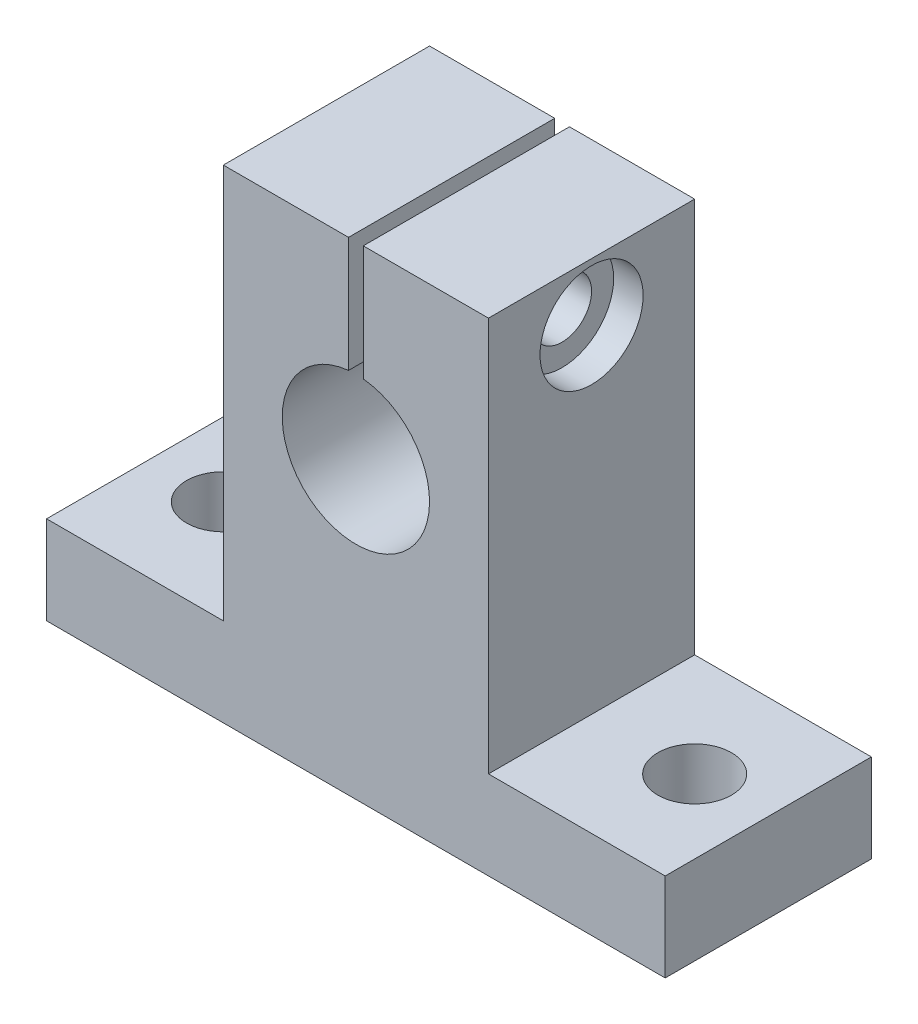
ISO-10303-21;
HEADER;
FILE_DESCRIPTION(('STEP AP214'),'2;1');
FILE_NAME('part.step','',(''),(''),'','','');
FILE_SCHEMA(('AUTOMOTIVE_DESIGN { 1 0 10303 214 1 1 1 1 }'));
ENDSEC;
DATA;
#1=APPLICATION_CONTEXT('core data for automotive mechanical design processes');
#2=APPLICATION_PROTOCOL_DEFINITION('international standard','automotive_design',2000,#1);
#3=PRODUCT_CONTEXT('',#1,'mechanical');
#4=PRODUCT('Part','Part','',(#3));
#5=PRODUCT_RELATED_PRODUCT_CATEGORY('part','',(#4));
#6=PRODUCT_DEFINITION_FORMATION('','',#4);
#7=PRODUCT_DEFINITION_CONTEXT('part definition',#1,'design');
#8=PRODUCT_DEFINITION('design','',#6,#7);
#9=PRODUCT_DEFINITION_SHAPE('','',#8);
#10=(LENGTH_UNIT() NAMED_UNIT(*) SI_UNIT(.MILLI.,.METRE.));
#11=(NAMED_UNIT(*) PLANE_ANGLE_UNIT() SI_UNIT($,.RADIAN.));
#12=(NAMED_UNIT(*) SI_UNIT($,.STERADIAN.) SOLID_ANGLE_UNIT());
#13=UNCERTAINTY_MEASURE_WITH_UNIT(LENGTH_MEASURE(1.E-05),#10,'distance_accuracy_value','');
#14=(GEOMETRIC_REPRESENTATION_CONTEXT(3) GLOBAL_UNCERTAINTY_ASSIGNED_CONTEXT((#13)) GLOBAL_UNIT_ASSIGNED_CONTEXT((#10,
#11,#12)) REPRESENTATION_CONTEXT('',''));
#15=CARTESIAN_POINT('',(0.,0.,0.));
#16=DIRECTION('',(0.,0.,1.));
#17=DIRECTION('',(1.,0.,0.));
#18=AXIS2_PLACEMENT_3D('',#15,#16,#17);
#19=CARTESIAN_POINT('',(-10.5,28.8874685927665,7.));
#20=DIRECTION('',(1.,0.,0.));
#21=DIRECTION('',(0.,0.,-1.));
#22=AXIS2_PLACEMENT_3D('',#19,#20,#21);
#23=CYLINDRICAL_SURFACE('',#22,2.);
#24=CARTESIAN_POINT('',(0.500000000000002,28.8874685927665,7.));
#25=DIRECTION('',(1.,0.,0.));
#26=DIRECTION('',(0.,0.,-1.));
#27=AXIS2_PLACEMENT_3D('',#24,#25,#26);
#28=CIRCLE('',#27,2.);
#29=CARTESIAN_POINT('',(0.500000000000002,28.8874685927665,5.));
#30=VERTEX_POINT('',#29);
#31=EDGE_CURVE('E202',#30,#30,#28,.T.);
#32=ORIENTED_EDGE('',*,*,#31,.F.);
#33=EDGE_LOOP('',(#32));
#34=FACE_BOUND('',#33,.T.);
#35=CARTESIAN_POINT('',(7.,28.8874685927665,7.));
#36=DIRECTION('',(1.,0.,0.));
#37=DIRECTION('',(0.,0.,-1.));
#38=AXIS2_PLACEMENT_3D('',#35,#36,#37);
#39=CIRCLE('',#38,2.);
#40=CARTESIAN_POINT('',(7.,28.8874685927665,5.));
#41=VERTEX_POINT('',#40);
#42=EDGE_CURVE('E38',#41,#41,#39,.F.);
#43=ORIENTED_EDGE('',*,*,#42,.F.);
#44=EDGE_LOOP('',(#43));
#45=FACE_BOUND('',#44,.T.);
#46=ADVANCED_FACE('F34',(#34,#45),#23,.F.);
#47=CARTESIAN_POINT('',(-9.,32.8,14.));
#48=DIRECTION('',(0.,-1.,0.));
#49=DIRECTION('',(0.,0.,-1.));
#50=AXIS2_PLACEMENT_3D('',#47,#48,#49);
#51=PLANE('',#50);
#52=DIRECTION('',(-1.,0.,0.));
#53=VECTOR('',#52,1.);
#54=CARTESIAN_POINT('',(-9.,32.8,14.));
#55=LINE('',#54,#53);
#56=CARTESIAN_POINT('',(-0.499999999999998,32.8,14.));
#57=VERTEX_POINT('',#56);
#58=CARTESIAN_POINT('',(-9.,32.8,14.));
#59=VERTEX_POINT('',#58);
#60=EDGE_CURVE('E135',#57,#59,#55,.T.);
#61=ORIENTED_EDGE('',*,*,#60,.F.);
#62=DIRECTION('',(0.,0.,1.));
#63=VECTOR('',#62,1.);
#64=CARTESIAN_POINT('',(-0.5,32.8,0.));
#65=LINE('',#64,#63);
#66=CARTESIAN_POINT('',(-0.5,32.8,0.));
#67=VERTEX_POINT('',#66);
#68=EDGE_CURVE('E122',#67,#57,#65,.T.);
#69=ORIENTED_EDGE('',*,*,#68,.F.);
#70=DIRECTION('',(-1.,0.,0.));
#71=VECTOR('',#70,1.);
#72=CARTESIAN_POINT('',(-9.,32.8,0.));
#73=LINE('',#72,#71);
#74=CARTESIAN_POINT('',(-9.,32.8,0.));
#75=VERTEX_POINT('',#74);
#76=EDGE_CURVE('E170',#67,#75,#73,.T.);
#77=ORIENTED_EDGE('',*,*,#76,.T.);
#78=DIRECTION('',(0.,0.,-1.));
#79=VECTOR('',#78,1.);
#80=CARTESIAN_POINT('',(-9.,32.8,14.));
#81=LINE('',#80,#79);
#82=EDGE_CURVE('E144',#59,#75,#81,.T.);
#83=ORIENTED_EDGE('',*,*,#82,.F.);
#84=EDGE_LOOP('',(#61,#69,#77,#83));
#85=FACE_BOUND('',#84,.T.);
#86=ADVANCED_FACE('F142',(#85),#51,.F.);
#87=CARTESIAN_POINT('',(0.,0.,14.));
#88=DIRECTION('',(0.,0.,-1.));
#89=DIRECTION('',(-1.,0.,0.));
#90=AXIS2_PLACEMENT_3D('',#87,#88,#89);
#91=PLANE('',#90);
#92=CARTESIAN_POINT('',(0.,20.,14.));
#93=DIRECTION('',(0.,0.,1.));
#94=DIRECTION('',(1.,0.,0.));
#95=AXIS2_PLACEMENT_3D('',#92,#93,#94);
#96=CIRCLE('',#95,5.);
#97=CARTESIAN_POINT('',(-0.499999999999998,24.9749371855331,14.));
#98=VERTEX_POINT('',#97);
#99=CARTESIAN_POINT('',(0.500000000000002,24.9749371855331,14.));
#100=VERTEX_POINT('',#99);
#101=EDGE_CURVE('E139',#98,#100,#96,.T.);
#102=ORIENTED_EDGE('',*,*,#101,.F.);
#103=DIRECTION('',(0.,1.,0.));
#104=VECTOR('',#103,1.);
#105=CARTESIAN_POINT('',(-0.499999999999998,18.8,14.));
#106=LINE('',#105,#104);
#107=EDGE_CURVE('E58',#98,#57,#106,.T.);
#108=ORIENTED_EDGE('',*,*,#107,.T.);
#109=ORIENTED_EDGE('',*,*,#60,.T.);
#110=DIRECTION('',(0.,-1.,0.));
#111=VECTOR('',#110,1.);
#112=CARTESIAN_POINT('',(-9.,6.,14.));
#113=LINE('',#112,#111);
#114=CARTESIAN_POINT('',(-9.,6.,14.));
#115=VERTEX_POINT('',#114);
#116=EDGE_CURVE('E150',#59,#115,#113,.T.);
#117=ORIENTED_EDGE('',*,*,#116,.T.);
#118=DIRECTION('',(-1.,0.,0.));
#119=VECTOR('',#118,1.);
#120=CARTESIAN_POINT('',(-21.,6.,14.));
#121=LINE('',#120,#119);
#122=CARTESIAN_POINT('',(-21.,6.,14.));
#123=VERTEX_POINT('',#122);
#124=EDGE_CURVE('E156',#115,#123,#121,.T.);
#125=ORIENTED_EDGE('',*,*,#124,.T.);
#126=DIRECTION('',(0.,-1.,0.));
#127=VECTOR('',#126,1.);
#128=CARTESIAN_POINT('',(-21.,0.,14.));
#129=LINE('',#128,#127);
#130=CARTESIAN_POINT('',(-21.,0.,14.));
#131=VERTEX_POINT('',#130);
#132=EDGE_CURVE('E178',#123,#131,#129,.T.);
#133=ORIENTED_EDGE('',*,*,#132,.T.);
#134=DIRECTION('',(1.,0.,0.));
#135=VECTOR('',#134,1.);
#136=CARTESIAN_POINT('',(21.,0.,14.));
#137=LINE('',#136,#135);
#138=CARTESIAN_POINT('',(21.,0.,14.));
#139=VERTEX_POINT('',#138);
#140=EDGE_CURVE('E243',#131,#139,#137,.T.);
#141=ORIENTED_EDGE('',*,*,#140,.T.);
#142=DIRECTION('',(0.,1.,0.));
#143=VECTOR('',#142,1.);
#144=CARTESIAN_POINT('',(21.,0.,14.));
#145=LINE('',#144,#143);
#146=CARTESIAN_POINT('',(21.,6.,14.));
#147=VERTEX_POINT('',#146);
#148=EDGE_CURVE('E245',#139,#147,#145,.T.);
#149=ORIENTED_EDGE('',*,*,#148,.T.);
#150=DIRECTION('',(-1.,0.,0.));
#151=VECTOR('',#150,1.);
#152=CARTESIAN_POINT('',(21.,6.,14.));
#153=LINE('',#152,#151);
#154=CARTESIAN_POINT('',(9.,6.,14.));
#155=VERTEX_POINT('',#154);
#156=EDGE_CURVE('E151',#147,#155,#153,.T.);
#157=ORIENTED_EDGE('',*,*,#156,.T.);
#158=DIRECTION('',(0.,1.,0.));
#159=VECTOR('',#158,1.);
#160=CARTESIAN_POINT('',(9.,6.,14.));
#161=LINE('',#160,#159);
#162=CARTESIAN_POINT('',(9.,32.8,14.));
#163=VERTEX_POINT('',#162);
#164=EDGE_CURVE('E147',#155,#163,#161,.T.);
#165=ORIENTED_EDGE('',*,*,#164,.T.);
#166=CARTESIAN_POINT('',(0.500000000000002,32.8,14.));
#167=VERTEX_POINT('',#166);
#168=EDGE_CURVE('E146',#163,#167,#55,.T.);
#169=ORIENTED_EDGE('',*,*,#168,.T.);
#170=DIRECTION('',(0.,1.,0.));
#171=VECTOR('',#170,1.);
#172=CARTESIAN_POINT('',(0.500000000000002,18.8,14.));
#173=LINE('',#172,#171);
#174=EDGE_CURVE('E140',#100,#167,#173,.T.);
#175=ORIENTED_EDGE('',*,*,#174,.F.);
#176=EDGE_LOOP('',(#102,#108,#109,#117,#125,#133,#141,#149,#157,#165,#169,#175));
#177=FACE_BOUND('',#176,.T.);
#178=ADVANCED_FACE('F134',(#177),#91,.F.);
#179=CARTESIAN_POINT('',(0.,0.,0.));
#180=DIRECTION('',(0.,0.,-1.));
#181=DIRECTION('',(-1.,0.,0.));
#182=AXIS2_PLACEMENT_3D('',#179,#180,#181);
#183=PLANE('',#182);
#184=DIRECTION('',(0.,1.,0.));
#185=VECTOR('',#184,1.);
#186=CARTESIAN_POINT('',(-0.5,18.8,0.));
#187=LINE('',#186,#185);
#188=CARTESIAN_POINT('',(-0.5,24.9749371855331,0.));
#189=VERTEX_POINT('',#188);
#190=EDGE_CURVE('E125',#189,#67,#187,.T.);
#191=ORIENTED_EDGE('',*,*,#190,.F.);
#192=CARTESIAN_POINT('',(0.,20.,0.));
#193=DIRECTION('',(0.,0.,1.));
#194=DIRECTION('',(1.,0.,0.));
#195=AXIS2_PLACEMENT_3D('',#192,#193,#194);
#196=CIRCLE('',#195,5.);
#197=CARTESIAN_POINT('',(0.500000000000002,24.9749371855331,0.));
#198=VERTEX_POINT('',#197);
#199=EDGE_CURVE('E235',#189,#198,#196,.T.);
#200=ORIENTED_EDGE('',*,*,#199,.T.);
#201=DIRECTION('',(0.,1.,0.));
#202=VECTOR('',#201,1.);
#203=CARTESIAN_POINT('',(0.5,18.8,0.));
#204=LINE('',#203,#202);
#205=CARTESIAN_POINT('',(0.5,32.8,0.));
#206=VERTEX_POINT('',#205);
#207=EDGE_CURVE('E51',#198,#206,#204,.T.);
#208=ORIENTED_EDGE('',*,*,#207,.T.);
#209=CARTESIAN_POINT('',(9.,32.8,0.));
#210=VERTEX_POINT('',#209);
#211=EDGE_CURVE('E171',#210,#206,#73,.T.);
#212=ORIENTED_EDGE('',*,*,#211,.F.);
#213=DIRECTION('',(0.,1.,0.));
#214=VECTOR('',#213,1.);
#215=CARTESIAN_POINT('',(9.,6.,0.));
#216=LINE('',#215,#214);
#217=CARTESIAN_POINT('',(9.,6.,0.));
#218=VERTEX_POINT('',#217);
#219=EDGE_CURVE('E168',#218,#210,#216,.T.);
#220=ORIENTED_EDGE('',*,*,#219,.F.);
#221=DIRECTION('',(-1.,0.,0.));
#222=VECTOR('',#221,1.);
#223=CARTESIAN_POINT('',(21.,6.,0.));
#224=LINE('',#223,#222);
#225=CARTESIAN_POINT('',(21.,6.,0.));
#226=VERTEX_POINT('',#225);
#227=EDGE_CURVE('E166',#226,#218,#224,.T.);
#228=ORIENTED_EDGE('',*,*,#227,.F.);
#229=DIRECTION('',(0.,1.,0.));
#230=VECTOR('',#229,1.);
#231=CARTESIAN_POINT('',(21.,0.,0.));
#232=LINE('',#231,#230);
#233=CARTESIAN_POINT('',(21.,0.,0.));
#234=VERTEX_POINT('',#233);
#235=EDGE_CURVE('E164',#234,#226,#232,.T.);
#236=ORIENTED_EDGE('',*,*,#235,.F.);
#237=DIRECTION('',(1.,0.,0.));
#238=VECTOR('',#237,1.);
#239=CARTESIAN_POINT('',(21.,0.,0.));
#240=LINE('',#239,#238);
#241=CARTESIAN_POINT('',(-21.,0.,0.));
#242=VERTEX_POINT('',#241);
#243=EDGE_CURVE('E162',#242,#234,#240,.T.);
#244=ORIENTED_EDGE('',*,*,#243,.F.);
#245=DIRECTION('',(0.,-1.,0.));
#246=VECTOR('',#245,1.);
#247=CARTESIAN_POINT('',(-21.,0.,0.));
#248=LINE('',#247,#246);
#249=CARTESIAN_POINT('',(-21.,6.,0.));
#250=VERTEX_POINT('',#249);
#251=EDGE_CURVE('E159',#250,#242,#248,.T.);
#252=ORIENTED_EDGE('',*,*,#251,.F.);
#253=DIRECTION('',(-1.,0.,0.));
#254=VECTOR('',#253,1.);
#255=CARTESIAN_POINT('',(-21.,6.,0.));
#256=LINE('',#255,#254);
#257=CARTESIAN_POINT('',(-9.,6.,0.));
#258=VERTEX_POINT('',#257);
#259=EDGE_CURVE('E176',#258,#250,#256,.T.);
#260=ORIENTED_EDGE('',*,*,#259,.F.);
#261=DIRECTION('',(0.,-1.,0.));
#262=VECTOR('',#261,1.);
#263=CARTESIAN_POINT('',(-9.,6.,0.));
#264=LINE('',#263,#262);
#265=EDGE_CURVE('E174',#75,#258,#264,.T.);
#266=ORIENTED_EDGE('',*,*,#265,.F.);
#267=ORIENTED_EDGE('',*,*,#76,.F.);
#268=EDGE_LOOP('',(#191,#200,#208,#212,#220,#228,#236,#244,#252,#260,#266,#267));
#269=FACE_BOUND('',#268,.T.);
#270=ADVANCED_FACE('F267',(#269),#183,.T.);
#271=CARTESIAN_POINT('',(-21.,0.,14.));
#272=DIRECTION('',(1.,0.,0.));
#273=DIRECTION('',(0.,1.,0.));
#274=AXIS2_PLACEMENT_3D('',#271,#272,#273);
#275=PLANE('',#274);
#276=ORIENTED_EDGE('',*,*,#251,.T.);
#277=DIRECTION('',(0.,0.,-1.));
#278=VECTOR('',#277,1.);
#279=CARTESIAN_POINT('',(-21.,0.,14.));
#280=LINE('',#279,#278);
#281=EDGE_CURVE('E197',#131,#242,#280,.T.);
#282=ORIENTED_EDGE('',*,*,#281,.F.);
#283=ORIENTED_EDGE('',*,*,#132,.F.);
#284=DIRECTION('',(0.,0.,-1.));
#285=VECTOR('',#284,1.);
#286=CARTESIAN_POINT('',(-21.,6.,14.));
#287=LINE('',#286,#285);
#288=EDGE_CURVE('E158',#123,#250,#287,.T.);
#289=ORIENTED_EDGE('',*,*,#288,.T.);
#290=EDGE_LOOP('',(#276,#282,#283,#289));
#291=FACE_BOUND('',#290,.T.);
#292=ADVANCED_FACE('F36',(#291),#275,.F.);
#293=CARTESIAN_POINT('',(21.,0.,14.));
#294=DIRECTION('',(0.,1.,0.));
#295=DIRECTION('',(0.,0.,1.));
#296=AXIS2_PLACEMENT_3D('',#293,#294,#295);
#297=PLANE('',#296);
#298=CARTESIAN_POINT('',(16.,0.,6.99999999999999));
#299=DIRECTION('',(0.,1.,0.));
#300=DIRECTION('',(1.,0.,0.));
#301=AXIS2_PLACEMENT_3D('',#298,#299,#300);
#302=CIRCLE('',#301,2.5);
#303=CARTESIAN_POINT('',(18.5,0.,6.99999999999999));
#304=VERTEX_POINT('',#303);
#305=EDGE_CURVE('E226',#304,#304,#302,.T.);
#306=ORIENTED_EDGE('',*,*,#305,.T.);
#307=EDGE_LOOP('',(#306));
#308=FACE_BOUND('',#307,.T.);
#309=CARTESIAN_POINT('',(-16.,0.,7.));
#310=DIRECTION('',(0.,1.,0.));
#311=DIRECTION('',(-1.,0.,0.));
#312=AXIS2_PLACEMENT_3D('',#309,#310,#311);
#313=CIRCLE('',#312,2.5);
#314=CARTESIAN_POINT('',(-18.5,0.,7.));
#315=VERTEX_POINT('',#314);
#316=EDGE_CURVE('E232',#315,#315,#313,.T.);
#317=ORIENTED_EDGE('',*,*,#316,.T.);
#318=EDGE_LOOP('',(#317));
#319=FACE_BOUND('',#318,.T.);
#320=ORIENTED_EDGE('',*,*,#243,.T.);
#321=DIRECTION('',(0.,0.,-1.));
#322=VECTOR('',#321,1.);
#323=CARTESIAN_POINT('',(21.,0.,14.));
#324=LINE('',#323,#322);
#325=EDGE_CURVE('E194',#139,#234,#324,.T.);
#326=ORIENTED_EDGE('',*,*,#325,.F.);
#327=ORIENTED_EDGE('',*,*,#140,.F.);
#328=ORIENTED_EDGE('',*,*,#281,.T.);
#329=EDGE_LOOP('',(#320,#326,#327,#328));
#330=FACE_BOUND('',#329,.T.);
#331=ADVANCED_FACE('F282',(#308,#319,#330),#297,.F.);
#332=CARTESIAN_POINT('',(21.,0.,14.));
#333=DIRECTION('',(-1.,0.,0.));
#334=DIRECTION('',(0.,-1.,0.));
#335=AXIS2_PLACEMENT_3D('',#332,#333,#334);
#336=PLANE('',#335);
#337=ORIENTED_EDGE('',*,*,#235,.T.);
#338=DIRECTION('',(0.,0.,-1.));
#339=VECTOR('',#338,1.);
#340=CARTESIAN_POINT('',(21.,6.,14.));
#341=LINE('',#340,#339);
#342=EDGE_CURVE('E191',#147,#226,#341,.T.);
#343=ORIENTED_EDGE('',*,*,#342,.F.);
#344=ORIENTED_EDGE('',*,*,#148,.F.);
#345=ORIENTED_EDGE('',*,*,#325,.T.);
#346=EDGE_LOOP('',(#337,#343,#344,#345));
#347=FACE_BOUND('',#346,.T.);
#348=ADVANCED_FACE('F286',(#347),#336,.F.);
#349=CARTESIAN_POINT('',(21.,6.,14.));
#350=DIRECTION('',(0.,-1.,0.));
#351=DIRECTION('',(1.,0.,0.));
#352=AXIS2_PLACEMENT_3D('',#349,#350,#351);
#353=PLANE('',#352);
#354=CARTESIAN_POINT('',(16.,6.,6.99999999999999));
#355=DIRECTION('',(0.,1.,0.));
#356=DIRECTION('',(1.,0.,0.));
#357=AXIS2_PLACEMENT_3D('',#354,#355,#356);
#358=CIRCLE('',#357,2.5);
#359=CARTESIAN_POINT('',(18.5,6.,6.99999999999999));
#360=VERTEX_POINT('',#359);
#361=EDGE_CURVE('E223',#360,#360,#358,.T.);
#362=ORIENTED_EDGE('',*,*,#361,.F.);
#363=EDGE_LOOP('',(#362));
#364=FACE_BOUND('',#363,.T.);
#365=ORIENTED_EDGE('',*,*,#227,.T.);
#366=DIRECTION('',(0.,0.,-1.));
#367=VECTOR('',#366,1.);
#368=CARTESIAN_POINT('',(9.,6.,14.));
#369=LINE('',#368,#367);
#370=EDGE_CURVE('E188',#155,#218,#369,.T.);
#371=ORIENTED_EDGE('',*,*,#370,.F.);
#372=ORIENTED_EDGE('',*,*,#156,.F.);
#373=ORIENTED_EDGE('',*,*,#342,.T.);
#374=EDGE_LOOP('',(#365,#371,#372,#373));
#375=FACE_BOUND('',#374,.T.);
#376=ADVANCED_FACE('F253',(#364,#375),#353,.F.);
#377=CARTESIAN_POINT('',(9.,6.,14.));
#378=DIRECTION('',(-1.,0.,0.));
#379=DIRECTION('',(0.,0.,1.));
#380=AXIS2_PLACEMENT_3D('',#377,#378,#379);
#381=PLANE('',#380);
#382=CARTESIAN_POINT('',(9.,28.8874685927665,7.));
#383=DIRECTION('',(1.,0.,0.));
#384=DIRECTION('',(0.,0.,-1.));
#385=AXIS2_PLACEMENT_3D('',#382,#383,#384);
#386=CIRCLE('',#385,3.5);
#387=CARTESIAN_POINT('',(9.,28.8874685927665,3.5));
#388=VERTEX_POINT('',#387);
#389=EDGE_CURVE('E212',#388,#388,#386,.T.);
#390=ORIENTED_EDGE('',*,*,#389,.F.);
#391=EDGE_LOOP('',(#390));
#392=FACE_BOUND('',#391,.T.);
#393=ORIENTED_EDGE('',*,*,#219,.T.);
#394=DIRECTION('',(0.,0.,-1.));
#395=VECTOR('',#394,1.);
#396=CARTESIAN_POINT('',(9.,32.8,14.));
#397=LINE('',#396,#395);
#398=EDGE_CURVE('E185',#163,#210,#397,.T.);
#399=ORIENTED_EDGE('',*,*,#398,.F.);
#400=ORIENTED_EDGE('',*,*,#164,.F.);
#401=ORIENTED_EDGE('',*,*,#370,.T.);
#402=EDGE_LOOP('',(#393,#399,#400,#401));
#403=FACE_BOUND('',#402,.T.);
#404=ADVANCED_FACE('F257',(#392,#403),#381,.F.);
#405=ORIENTED_EDGE('',*,*,#211,.T.);
#406=DIRECTION('',(0.,0.,-1.));
#407=VECTOR('',#406,1.);
#408=CARTESIAN_POINT('',(0.5,32.8,0.));
#409=LINE('',#408,#407);
#410=EDGE_CURVE('E129',#167,#206,#409,.T.);
#411=ORIENTED_EDGE('',*,*,#410,.F.);
#412=ORIENTED_EDGE('',*,*,#168,.F.);
#413=ORIENTED_EDGE('',*,*,#398,.T.);
#414=EDGE_LOOP('',(#405,#411,#412,#413));
#415=FACE_BOUND('',#414,.T.);
#416=ADVANCED_FACE('F262',(#415),#51,.F.);
#417=CARTESIAN_POINT('',(-9.,6.,14.));
#418=DIRECTION('',(1.,0.,0.));
#419=DIRECTION('',(0.,0.,-1.));
#420=AXIS2_PLACEMENT_3D('',#417,#418,#419);
#421=PLANE('',#420);
#422=CARTESIAN_POINT('',(-9.,28.8874685927665,7.));
#423=DIRECTION('',(1.,0.,0.));
#424=DIRECTION('',(0.,0.,-1.));
#425=AXIS2_PLACEMENT_3D('',#422,#423,#424);
#426=CIRCLE('',#425,2.);
#427=CARTESIAN_POINT('',(-9.,28.8874685927665,5.));
#428=VERTEX_POINT('',#427);
#429=EDGE_CURVE('E130',#428,#428,#426,.T.);
#430=ORIENTED_EDGE('',*,*,#429,.T.);
#431=EDGE_LOOP('',(#430));
#432=FACE_BOUND('',#431,.T.);
#433=ORIENTED_EDGE('',*,*,#265,.T.);
#434=DIRECTION('',(0.,0.,-1.));
#435=VECTOR('',#434,1.);
#436=CARTESIAN_POINT('',(-9.,6.,14.));
#437=LINE('',#436,#435);
#438=EDGE_CURVE('E181',#115,#258,#437,.T.);
#439=ORIENTED_EDGE('',*,*,#438,.F.);
#440=ORIENTED_EDGE('',*,*,#116,.F.);
#441=ORIENTED_EDGE('',*,*,#82,.T.);
#442=EDGE_LOOP('',(#433,#439,#440,#441));
#443=FACE_BOUND('',#442,.T.);
#444=ADVANCED_FACE('F271',(#432,#443),#421,.F.);
#445=CARTESIAN_POINT('',(-21.,6.,14.));
#446=DIRECTION('',(0.,-1.,0.));
#447=DIRECTION('',(1.,0.,0.));
#448=AXIS2_PLACEMENT_3D('',#445,#446,#447);
#449=PLANE('',#448);
#450=CARTESIAN_POINT('',(-16.,5.99999999999999,7.));
#451=DIRECTION('',(0.,1.,0.));
#452=DIRECTION('',(-1.,0.,0.));
#453=AXIS2_PLACEMENT_3D('',#450,#451,#452);
#454=CIRCLE('',#453,2.5);
#455=CARTESIAN_POINT('',(-18.5,5.99999999999999,7.));
#456=VERTEX_POINT('',#455);
#457=EDGE_CURVE('E229',#456,#456,#454,.T.);
#458=ORIENTED_EDGE('',*,*,#457,.F.);
#459=EDGE_LOOP('',(#458));
#460=FACE_BOUND('',#459,.T.);
#461=ORIENTED_EDGE('',*,*,#259,.T.);
#462=ORIENTED_EDGE('',*,*,#288,.F.);
#463=ORIENTED_EDGE('',*,*,#124,.F.);
#464=ORIENTED_EDGE('',*,*,#438,.T.);
#465=EDGE_LOOP('',(#461,#462,#463,#464));
#466=FACE_BOUND('',#465,.T.);
#467=ADVANCED_FACE('F278',(#460,#466),#449,.F.);
#468=CARTESIAN_POINT('',(0.,20.,14.));
#469=DIRECTION('',(0.,0.,-1.));
#470=DIRECTION('',(-1.,0.,0.));
#471=AXIS2_PLACEMENT_3D('',#468,#469,#470);
#472=CYLINDRICAL_SURFACE('',#471,5.);
#473=DIRECTION('',(0.,0.,-1.));
#474=VECTOR('',#473,1.);
#475=CARTESIAN_POINT('',(-0.499999999999998,24.9749371855331,14.));
#476=LINE('',#475,#474);
#477=EDGE_CURVE('E11',#98,#189,#476,.T.);
#478=ORIENTED_EDGE('',*,*,#477,.F.);
#479=ORIENTED_EDGE('',*,*,#101,.T.);
#480=DIRECTION('',(0.,0.,-1.));
#481=VECTOR('',#480,1.);
#482=CARTESIAN_POINT('',(0.500000000000002,24.9749371855331,14.));
#483=LINE('',#482,#481);
#484=EDGE_CURVE('E43',#198,#100,#483,.F.);
#485=ORIENTED_EDGE('',*,*,#484,.F.);
#486=ORIENTED_EDGE('',*,*,#199,.F.);
#487=EDGE_LOOP('',(#478,#479,#485,#486));
#488=FACE_BOUND('',#487,.T.);
#489=ADVANCED_FACE('F264',(#488),#472,.F.);
#490=CARTESIAN_POINT('',(-16.,0.,7.));
#491=DIRECTION('',(0.,1.,0.));
#492=DIRECTION('',(-1.,0.,0.));
#493=AXIS2_PLACEMENT_3D('',#490,#491,#492);
#494=CYLINDRICAL_SURFACE('',#493,2.5);
#495=ORIENTED_EDGE('',*,*,#316,.F.);
#496=EDGE_LOOP('',(#495));
#497=FACE_BOUND('',#496,.T.);
#498=ORIENTED_EDGE('',*,*,#457,.T.);
#499=EDGE_LOOP('',(#498));
#500=FACE_BOUND('',#499,.T.);
#501=ADVANCED_FACE('F386',(#497,#500),#494,.F.);
#502=CARTESIAN_POINT('',(16.,0.,6.99999999999999));
#503=DIRECTION('',(0.,1.,0.));
#504=DIRECTION('',(-1.,0.,0.));
#505=AXIS2_PLACEMENT_3D('',#502,#503,#504);
#506=CYLINDRICAL_SURFACE('',#505,2.5);
#507=ORIENTED_EDGE('',*,*,#305,.F.);
#508=EDGE_LOOP('',(#507));
#509=FACE_BOUND('',#508,.T.);
#510=ORIENTED_EDGE('',*,*,#361,.T.);
#511=EDGE_LOOP('',(#510));
#512=FACE_BOUND('',#511,.T.);
#513=ADVANCED_FACE('F372',(#509,#512),#506,.F.);
#514=CARTESIAN_POINT('',(0.5,18.8,0.));
#515=DIRECTION('',(1.,0.,0.));
#516=DIRECTION('',(0.,0.,-1.));
#517=AXIS2_PLACEMENT_3D('',#514,#515,#516);
#518=PLANE('',#517);
#519=ORIENTED_EDGE('',*,*,#31,.T.);
#520=EDGE_LOOP('',(#519));
#521=FACE_BOUND('',#520,.T.);
#522=ORIENTED_EDGE('',*,*,#484,.T.);
#523=ORIENTED_EDGE('',*,*,#174,.T.);
#524=ORIENTED_EDGE('',*,*,#410,.T.);
#525=ORIENTED_EDGE('',*,*,#207,.F.);
#526=EDGE_LOOP('',(#522,#523,#524,#525));
#527=FACE_BOUND('',#526,.T.);
#528=ADVANCED_FACE('F318',(#521,#527),#518,.F.);
#529=CARTESIAN_POINT('',(-0.5,18.8,0.));
#530=DIRECTION('',(-1.,0.,0.));
#531=DIRECTION('',(0.,0.,1.));
#532=AXIS2_PLACEMENT_3D('',#529,#530,#531);
#533=PLANE('',#532);
#534=CARTESIAN_POINT('',(-0.499999999999999,28.8874685927665,7.));
#535=DIRECTION('',(-1.,0.,0.));
#536=DIRECTION('',(0.,0.,1.));
#537=AXIS2_PLACEMENT_3D('',#534,#535,#536);
#538=CIRCLE('',#537,2.);
#539=CARTESIAN_POINT('',(-0.499999999999999,28.8874685927665,9.00000000000001));
#540=VERTEX_POINT('',#539);
#541=EDGE_CURVE('E200',#540,#540,#538,.T.);
#542=ORIENTED_EDGE('',*,*,#541,.T.);
#543=EDGE_LOOP('',(#542));
#544=FACE_BOUND('',#543,.T.);
#545=ORIENTED_EDGE('',*,*,#477,.T.);
#546=ORIENTED_EDGE('',*,*,#190,.T.);
#547=ORIENTED_EDGE('',*,*,#68,.T.);
#548=ORIENTED_EDGE('',*,*,#107,.F.);
#549=EDGE_LOOP('',(#545,#546,#547,#548));
#550=FACE_BOUND('',#549,.T.);
#551=ADVANCED_FACE('F123',(#544,#550),#533,.F.);
#552=ORIENTED_EDGE('',*,*,#541,.F.);
#553=EDGE_LOOP('',(#552));
#554=FACE_BOUND('',#553,.T.);
#555=ORIENTED_EDGE('',*,*,#429,.F.);
#556=EDGE_LOOP('',(#555));
#557=FACE_BOUND('',#556,.T.);
#558=ADVANCED_FACE('F299',(#554,#557),#23,.F.);
#559=CARTESIAN_POINT('',(7.,28.8874685927665,7.));
#560=DIRECTION('',(1.,0.,0.));
#561=DIRECTION('',(0.,0.,-1.));
#562=AXIS2_PLACEMENT_3D('',#559,#560,#561);
#563=PLANE('',#562);
#564=CARTESIAN_POINT('',(7.,28.8874685927665,7.));
#565=DIRECTION('',(1.,0.,0.));
#566=DIRECTION('',(0.,0.,-1.));
#567=AXIS2_PLACEMENT_3D('',#564,#565,#566);
#568=CIRCLE('',#567,3.5);
#569=CARTESIAN_POINT('',(7.,28.8874685927665,3.5));
#570=VERTEX_POINT('',#569);
#571=EDGE_CURVE('E208',#570,#570,#568,.T.);
#572=ORIENTED_EDGE('',*,*,#571,.T.);
#573=EDGE_LOOP('',(#572));
#574=FACE_BOUND('',#573,.T.);
#575=ORIENTED_EDGE('',*,*,#42,.T.);
#576=EDGE_LOOP('',(#575));
#577=FACE_BOUND('',#576,.T.);
#578=ADVANCED_FACE('F310',(#574,#577),#563,.T.);
#579=CARTESIAN_POINT('',(7.,28.8874685927665,7.));
#580=DIRECTION('',(1.,0.,0.));
#581=DIRECTION('',(0.,0.,-1.));
#582=AXIS2_PLACEMENT_3D('',#579,#580,#581);
#583=CYLINDRICAL_SURFACE('',#582,3.5);
#584=ORIENTED_EDGE('',*,*,#571,.F.);
#585=EDGE_LOOP('',(#584));
#586=FACE_BOUND('',#585,.T.);
#587=ORIENTED_EDGE('',*,*,#389,.T.);
#588=EDGE_LOOP('',(#587));
#589=FACE_BOUND('',#588,.T.);
#590=ADVANCED_FACE('F315',(#586,#589),#583,.F.);
#591=CLOSED_SHELL('',(#46,#86,#178,#270,#292,#331,#348,#376,#404,#416,#444,#467,#489,#501,#513,
#528,#551,#558,#578,#590));
#592=MANIFOLD_SOLID_BREP('B2',#591);
#593=ADVANCED_BREP_SHAPE_REPRESENTATION('',(#18,#592),#14);
#594=SHAPE_DEFINITION_REPRESENTATION(#9,#593);
ENDSEC;
END-ISO-10303-21;
